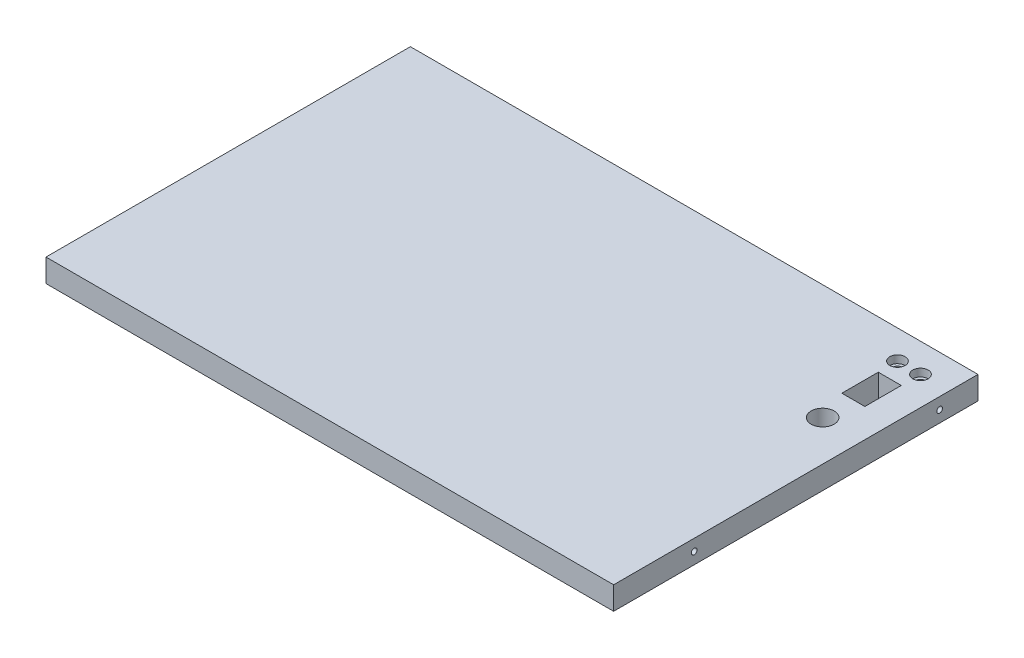
ISO-10303-21;
HEADER;
FILE_DESCRIPTION(('STEP AP214'),'2;1');
FILE_NAME('part.step','',(''),(''),'','','');
FILE_SCHEMA(('AUTOMOTIVE_DESIGN { 1 0 10303 214 1 1 1 1 }'));
ENDSEC;
DATA;
#1=APPLICATION_CONTEXT('core data for automotive mechanical design processes');
#2=APPLICATION_PROTOCOL_DEFINITION('international standard','automotive_design',2000,#1);
#3=PRODUCT_CONTEXT('',#1,'mechanical');
#4=PRODUCT('Part','Part','',(#3));
#5=PRODUCT_RELATED_PRODUCT_CATEGORY('part','',(#4));
#6=PRODUCT_DEFINITION_FORMATION('','',#4);
#7=PRODUCT_DEFINITION_CONTEXT('part definition',#1,'design');
#8=PRODUCT_DEFINITION('design','',#6,#7);
#9=PRODUCT_DEFINITION_SHAPE('','',#8);
#10=(LENGTH_UNIT() NAMED_UNIT(*) SI_UNIT(.MILLI.,.METRE.));
#11=(NAMED_UNIT(*) PLANE_ANGLE_UNIT() SI_UNIT($,.RADIAN.));
#12=(NAMED_UNIT(*) SI_UNIT($,.STERADIAN.) SOLID_ANGLE_UNIT());
#13=UNCERTAINTY_MEASURE_WITH_UNIT(LENGTH_MEASURE(1.E-05),#10,'distance_accuracy_value','');
#14=(GEOMETRIC_REPRESENTATION_CONTEXT(3) GLOBAL_UNCERTAINTY_ASSIGNED_CONTEXT((#13)) GLOBAL_UNIT_ASSIGNED_CONTEXT((#10,
#11,#12)) REPRESENTATION_CONTEXT('',''));
#15=CARTESIAN_POINT('',(0.,0.,0.));
#16=DIRECTION('',(0.,0.,1.));
#17=DIRECTION('',(1.,0.,0.));
#18=AXIS2_PLACEMENT_3D('',#15,#16,#17);
#19=CARTESIAN_POINT('',(77.787049363223,12.,-103.31238787846));
#20=DIRECTION('',(0.,-1.,0.));
#21=DIRECTION('',(0.,0.,-1.));
#22=AXIS2_PLACEMENT_3D('',#19,#20,#21);
#23=CYLINDRICAL_SURFACE('',#22,2.50000000000001);
#24=CARTESIAN_POINT('',(77.787049363223,0.,-103.31238787846));
#25=DIRECTION('',(0.,1.,0.));
#26=DIRECTION('',(0.,0.,1.));
#27=AXIS2_PLACEMENT_3D('',#24,#25,#26);
#28=CIRCLE('',#27,2.50000000000001);
#29=CARTESIAN_POINT('',(77.787049363223,0.,-100.81238787846));
#30=VERTEX_POINT('',#29);
#31=EDGE_CURVE('E201',#30,#30,#28,.T.);
#32=ORIENTED_EDGE('',*,*,#31,.F.);
#33=EDGE_LOOP('',(#32));
#34=FACE_BOUND('',#33,.T.);
#35=CARTESIAN_POINT('',(77.787049363223,8.,-103.31238787846));
#36=DIRECTION('',(0.,1.,0.));
#37=DIRECTION('',(0.,0.,1.));
#38=AXIS2_PLACEMENT_3D('',#35,#36,#37);
#39=CIRCLE('',#38,2.50000000000001);
#40=CARTESIAN_POINT('',(77.787049363223,8.,-100.81238787846));
#41=VERTEX_POINT('',#40);
#42=EDGE_CURVE('E36',#41,#41,#39,.T.);
#43=ORIENTED_EDGE('',*,*,#42,.T.);
#44=EDGE_LOOP('',(#43));
#45=FACE_BOUND('',#44,.T.);
#46=ADVANCED_FACE('F32',(#34,#45),#23,.F.);
#47=CARTESIAN_POINT('',(89.787049363223,12.,-103.31238787846));
#48=DIRECTION('',(0.,-1.,0.));
#49=DIRECTION('',(0.,0.,-1.));
#50=AXIS2_PLACEMENT_3D('',#47,#48,#49);
#51=CYLINDRICAL_SURFACE('',#50,2.5);
#52=CARTESIAN_POINT('',(89.787049363223,0.,-103.31238787846));
#53=DIRECTION('',(0.,1.,0.));
#54=DIRECTION('',(0.,0.,1.));
#55=AXIS2_PLACEMENT_3D('',#52,#53,#54);
#56=CIRCLE('',#55,2.5);
#57=CARTESIAN_POINT('',(89.787049363223,0.,-100.81238787846));
#58=VERTEX_POINT('',#57);
#59=EDGE_CURVE('E206',#58,#58,#56,.T.);
#60=ORIENTED_EDGE('',*,*,#59,.F.);
#61=EDGE_LOOP('',(#60));
#62=FACE_BOUND('',#61,.T.);
#63=CARTESIAN_POINT('',(89.787049363223,8.,-103.31238787846));
#64=DIRECTION('',(0.,1.,0.));
#65=DIRECTION('',(0.,0.,1.));
#66=AXIS2_PLACEMENT_3D('',#63,#64,#65);
#67=CIRCLE('',#66,2.5);
#68=CARTESIAN_POINT('',(89.787049363223,8.,-100.81238787846));
#69=VERTEX_POINT('',#68);
#70=EDGE_CURVE('E163',#69,#69,#67,.T.);
#71=ORIENTED_EDGE('',*,*,#70,.T.);
#72=EDGE_LOOP('',(#71));
#73=FACE_BOUND('',#72,.T.);
#74=ADVANCED_FACE('F234',(#62,#73),#51,.F.);
#75=CARTESIAN_POINT('',(0.,12.,0.));
#76=DIRECTION('',(0.,1.,0.));
#77=DIRECTION('',(0.,0.,1.));
#78=AXIS2_PLACEMENT_3D('',#75,#76,#77);
#79=PLANE('',#78);
#80=CARTESIAN_POINT('',(77.787049363223,12.,-103.31238787846));
#81=DIRECTION('',(0.,1.,0.));
#82=DIRECTION('',(0.,0.,1.));
#83=AXIS2_PLACEMENT_3D('',#80,#81,#82);
#84=CIRCLE('',#83,3.99999999999999);
#85=CARTESIAN_POINT('',(77.787049363223,12.,-99.3123878784597));
#86=VERTEX_POINT('',#85);
#87=EDGE_CURVE('E180',#86,#86,#84,.T.);
#88=ORIENTED_EDGE('',*,*,#87,.F.);
#89=EDGE_LOOP('',(#88));
#90=FACE_BOUND('',#89,.T.);
#91=CARTESIAN_POINT('',(89.787049363223,12.,-103.31238787846));
#92=DIRECTION('',(0.,1.,0.));
#93=DIRECTION('',(0.,0.,1.));
#94=AXIS2_PLACEMENT_3D('',#91,#92,#93);
#95=CIRCLE('',#94,3.99999999999999);
#96=CARTESIAN_POINT('',(89.787049363223,12.,-99.3123878784597));
#97=VERTEX_POINT('',#96);
#98=EDGE_CURVE('E173',#97,#97,#95,.T.);
#99=ORIENTED_EDGE('',*,*,#98,.F.);
#100=EDGE_LOOP('',(#99));
#101=FACE_BOUND('',#100,.T.);
#102=DIRECTION('',(1.,0.,0.));
#103=VECTOR('',#102,1.);
#104=CARTESIAN_POINT('',(77.787049363223,12.,-74.3123878784597));
#105=LINE('',#104,#103);
#106=CARTESIAN_POINT('',(77.787049363223,12.,-74.3123878784597));
#107=VERTEX_POINT('',#106);
#108=CARTESIAN_POINT('',(89.787049363223,12.,-74.3123878784597));
#109=VERTEX_POINT('',#108);
#110=EDGE_CURVE('E107',#107,#109,#105,.T.);
#111=ORIENTED_EDGE('',*,*,#110,.F.);
#112=DIRECTION('',(0.,0.,1.));
#113=VECTOR('',#112,1.);
#114=CARTESIAN_POINT('',(77.787049363223,12.,-93.3123878784597));
#115=LINE('',#114,#113);
#116=CARTESIAN_POINT('',(77.787049363223,12.,-93.3123878784597));
#117=VERTEX_POINT('',#116);
#118=EDGE_CURVE('E99',#117,#107,#115,.T.);
#119=ORIENTED_EDGE('',*,*,#118,.F.);
#120=DIRECTION('',(-1.,0.,0.));
#121=VECTOR('',#120,1.);
#122=CARTESIAN_POINT('',(77.787049363223,12.,-93.3123878784597));
#123=LINE('',#122,#121);
#124=CARTESIAN_POINT('',(89.787049363223,12.,-93.3123878784597));
#125=VERTEX_POINT('',#124);
#126=EDGE_CURVE('E123',#125,#117,#123,.T.);
#127=ORIENTED_EDGE('',*,*,#126,.F.);
#128=DIRECTION('',(0.,0.,-1.));
#129=VECTOR('',#128,1.);
#130=CARTESIAN_POINT('',(89.787049363223,12.,-93.3123878784597));
#131=LINE('',#130,#129);
#132=EDGE_CURVE('E121',#109,#125,#131,.T.);
#133=ORIENTED_EDGE('',*,*,#132,.F.);
#134=EDGE_LOOP('',(#111,#119,#127,#133));
#135=FACE_BOUND('',#134,.T.);
#136=DIRECTION('',(0.,0.,1.));
#137=VECTOR('',#136,1.);
#138=CARTESIAN_POINT('',(-191.212950636777,12.,-118.31238787846));
#139=LINE('',#138,#137);
#140=CARTESIAN_POINT('',(-191.212950636777,12.,-118.31238787846));
#141=VERTEX_POINT('',#140);
#142=CARTESIAN_POINT('',(-191.212950636777,12.,71.6876121215403));
#143=VERTEX_POINT('',#142);
#144=EDGE_CURVE('E139',#141,#143,#139,.T.);
#145=ORIENTED_EDGE('',*,*,#144,.T.);
#146=DIRECTION('',(1.,0.,0.));
#147=VECTOR('',#146,1.);
#148=CARTESIAN_POINT('',(-191.212950636777,12.,71.6876121215403));
#149=LINE('',#148,#147);
#150=CARTESIAN_POINT('',(104.787049363223,12.,71.6876121215403));
#151=VERTEX_POINT('',#150);
#152=EDGE_CURVE('E142',#143,#151,#149,.T.);
#153=ORIENTED_EDGE('',*,*,#152,.T.);
#154=DIRECTION('',(0.,0.,-1.));
#155=VECTOR('',#154,1.);
#156=CARTESIAN_POINT('',(104.787049363223,12.,-118.31238787846));
#157=LINE('',#156,#155);
#158=CARTESIAN_POINT('',(104.787049363223,12.,-118.31238787846));
#159=VERTEX_POINT('',#158);
#160=EDGE_CURVE('E145',#151,#159,#157,.T.);
#161=ORIENTED_EDGE('',*,*,#160,.T.);
#162=DIRECTION('',(-1.,0.,0.));
#163=VECTOR('',#162,1.);
#164=CARTESIAN_POINT('',(-191.212950636777,12.,-118.31238787846));
#165=LINE('',#164,#163);
#166=EDGE_CURVE('E147',#159,#141,#165,.T.);
#167=ORIENTED_EDGE('',*,*,#166,.T.);
#168=EDGE_LOOP('',(#145,#153,#161,#167));
#169=FACE_BOUND('',#168,.T.);
#170=CARTESIAN_POINT('',(83.787049363223,12.,-58.3123878784597));
#171=DIRECTION('',(0.,1.,0.));
#172=DIRECTION('',(0.,0.,1.));
#173=AXIS2_PLACEMENT_3D('',#170,#171,#172);
#174=CIRCLE('',#173,6.00000000000002);
#175=CARTESIAN_POINT('',(83.787049363223,12.,-52.3123878784597));
#176=VERTEX_POINT('',#175);
#177=EDGE_CURVE('E129',#176,#176,#174,.T.);
#178=ORIENTED_EDGE('',*,*,#177,.F.);
#179=EDGE_LOOP('',(#178));
#180=FACE_BOUND('',#179,.T.);
#181=ADVANCED_FACE('F119',(#90,#101,#135,#169,#180),#79,.T.);
#182=CARTESIAN_POINT('',(0.,0.,0.));
#183=DIRECTION('',(0.,1.,0.));
#184=DIRECTION('',(0.,0.,1.));
#185=AXIS2_PLACEMENT_3D('',#182,#183,#184);
#186=PLANE('',#185);
#187=DIRECTION('',(0.,0.,1.));
#188=VECTOR('',#187,1.);
#189=CARTESIAN_POINT('',(-191.212950636777,0.,-118.31238787846));
#190=LINE('',#189,#188);
#191=CARTESIAN_POINT('',(-191.212950636777,0.,-118.31238787846));
#192=VERTEX_POINT('',#191);
#193=CARTESIAN_POINT('',(-191.212950636777,0.,71.6876121215403));
#194=VERTEX_POINT('',#193);
#195=EDGE_CURVE('E115',#192,#194,#190,.T.);
#196=ORIENTED_EDGE('',*,*,#195,.F.);
#197=DIRECTION('',(-1.,0.,0.));
#198=VECTOR('',#197,1.);
#199=CARTESIAN_POINT('',(-191.212950636777,0.,-118.31238787846));
#200=LINE('',#199,#198);
#201=CARTESIAN_POINT('',(104.787049363223,0.,-118.31238787846));
#202=VERTEX_POINT('',#201);
#203=EDGE_CURVE('E143',#202,#192,#200,.T.);
#204=ORIENTED_EDGE('',*,*,#203,.F.);
#205=DIRECTION('',(0.,0.,-1.));
#206=VECTOR('',#205,1.);
#207=CARTESIAN_POINT('',(104.787049363223,0.,-118.31238787846));
#208=LINE('',#207,#206);
#209=CARTESIAN_POINT('',(104.787049363223,0.,71.6876121215403));
#210=VERTEX_POINT('',#209);
#211=EDGE_CURVE('E154',#210,#202,#208,.T.);
#212=ORIENTED_EDGE('',*,*,#211,.F.);
#213=DIRECTION('',(1.,0.,0.));
#214=VECTOR('',#213,1.);
#215=CARTESIAN_POINT('',(-191.212950636777,0.,71.6876121215403));
#216=LINE('',#215,#214);
#217=EDGE_CURVE('E152',#194,#210,#216,.T.);
#218=ORIENTED_EDGE('',*,*,#217,.F.);
#219=EDGE_LOOP('',(#196,#204,#212,#218));
#220=FACE_BOUND('',#219,.T.);
#221=DIRECTION('',(0.,0.,1.));
#222=VECTOR('',#221,1.);
#223=CARTESIAN_POINT('',(77.787049363223,0.,-93.3123878784597));
#224=LINE('',#223,#222);
#225=CARTESIAN_POINT('',(77.787049363223,0.,-93.3123878784597));
#226=VERTEX_POINT('',#225);
#227=CARTESIAN_POINT('',(77.787049363223,0.,-74.3123878784597));
#228=VERTEX_POINT('',#227);
#229=EDGE_CURVE('E57',#226,#228,#224,.T.);
#230=ORIENTED_EDGE('',*,*,#229,.T.);
#231=DIRECTION('',(1.,0.,0.));
#232=VECTOR('',#231,1.);
#233=CARTESIAN_POINT('',(77.787049363223,0.,-74.3123878784597));
#234=LINE('',#233,#232);
#235=CARTESIAN_POINT('',(89.787049363223,0.,-74.3123878784597));
#236=VERTEX_POINT('',#235);
#237=EDGE_CURVE('E114',#228,#236,#234,.T.);
#238=ORIENTED_EDGE('',*,*,#237,.T.);
#239=DIRECTION('',(0.,0.,-1.));
#240=VECTOR('',#239,1.);
#241=CARTESIAN_POINT('',(89.787049363223,0.,-93.3123878784597));
#242=LINE('',#241,#240);
#243=CARTESIAN_POINT('',(89.787049363223,0.,-93.3123878784597));
#244=VERTEX_POINT('',#243);
#245=EDGE_CURVE('E131',#236,#244,#242,.T.);
#246=ORIENTED_EDGE('',*,*,#245,.T.);
#247=DIRECTION('',(-1.,0.,0.));
#248=VECTOR('',#247,1.);
#249=CARTESIAN_POINT('',(77.787049363223,0.,-93.3123878784597));
#250=LINE('',#249,#248);
#251=EDGE_CURVE('E108',#244,#226,#250,.T.);
#252=ORIENTED_EDGE('',*,*,#251,.T.);
#253=EDGE_LOOP('',(#230,#238,#246,#252));
#254=FACE_BOUND('',#253,.T.);
#255=CARTESIAN_POINT('',(83.787049363223,0.,-58.3123878784597));
#256=DIRECTION('',(0.,1.,0.));
#257=DIRECTION('',(0.,0.,1.));
#258=AXIS2_PLACEMENT_3D('',#255,#256,#257);
#259=CIRCLE('',#258,6.00000000000002);
#260=CARTESIAN_POINT('',(83.787049363223,0.,-52.3123878784597));
#261=VERTEX_POINT('',#260);
#262=EDGE_CURVE('E209',#261,#261,#259,.T.);
#263=ORIENTED_EDGE('',*,*,#262,.T.);
#264=EDGE_LOOP('',(#263));
#265=FACE_BOUND('',#264,.T.);
#266=ORIENTED_EDGE('',*,*,#59,.T.);
#267=EDGE_LOOP('',(#266));
#268=FACE_BOUND('',#267,.T.);
#269=ORIENTED_EDGE('',*,*,#31,.T.);
#270=EDGE_LOOP('',(#269));
#271=FACE_BOUND('',#270,.T.);
#272=ADVANCED_FACE('F214',(#220,#254,#265,#268,#271),#186,.F.);
#273=CARTESIAN_POINT('',(-191.212950636777,12.,-118.31238787846));
#274=DIRECTION('',(1.,0.,0.));
#275=DIRECTION('',(0.,0.,-1.));
#276=AXIS2_PLACEMENT_3D('',#273,#274,#275);
#277=PLANE('',#276);
#278=CARTESIAN_POINT('',(-191.212950636777,6.,29.6876121215403));
#279=DIRECTION('',(1.,0.,0.));
#280=DIRECTION('',(0.,0.,-1.));
#281=AXIS2_PLACEMENT_3D('',#278,#279,#280);
#282=CIRCLE('',#281,1.5);
#283=CARTESIAN_POINT('',(-191.212950636777,6.,28.1876121215403));
#284=VERTEX_POINT('',#283);
#285=EDGE_CURVE('E165',#284,#284,#282,.T.);
#286=ORIENTED_EDGE('',*,*,#285,.T.);
#287=EDGE_LOOP('',(#286));
#288=FACE_BOUND('',#287,.T.);
#289=CARTESIAN_POINT('',(-191.212950636777,6.,-98.3123878784597));
#290=DIRECTION('',(1.,0.,0.));
#291=DIRECTION('',(0.,0.,-1.));
#292=AXIS2_PLACEMENT_3D('',#289,#290,#291);
#293=CIRCLE('',#292,1.5);
#294=CARTESIAN_POINT('',(-191.212950636777,6.,-99.8123878784597));
#295=VERTEX_POINT('',#294);
#296=EDGE_CURVE('E184',#295,#295,#293,.T.);
#297=ORIENTED_EDGE('',*,*,#296,.T.);
#298=EDGE_LOOP('',(#297));
#299=FACE_BOUND('',#298,.T.);
#300=ORIENTED_EDGE('',*,*,#195,.T.);
#301=DIRECTION('',(0.,-1.,0.));
#302=VECTOR('',#301,1.);
#303=CARTESIAN_POINT('',(-191.212950636777,12.,71.6876121215403));
#304=LINE('',#303,#302);
#305=EDGE_CURVE('E11',#143,#194,#304,.T.);
#306=ORIENTED_EDGE('',*,*,#305,.F.);
#307=ORIENTED_EDGE('',*,*,#144,.F.);
#308=DIRECTION('',(0.,-1.,0.));
#309=VECTOR('',#308,1.);
#310=CARTESIAN_POINT('',(-191.212950636777,12.,-118.31238787846));
#311=LINE('',#310,#309);
#312=EDGE_CURVE('E149',#141,#192,#311,.T.);
#313=ORIENTED_EDGE('',*,*,#312,.T.);
#314=EDGE_LOOP('',(#300,#306,#307,#313));
#315=FACE_BOUND('',#314,.T.);
#316=ADVANCED_FACE('F34',(#288,#299,#315),#277,.F.);
#317=CARTESIAN_POINT('',(-191.212950636777,12.,71.6876121215403));
#318=DIRECTION('',(0.,0.,-1.));
#319=DIRECTION('',(-1.,0.,0.));
#320=AXIS2_PLACEMENT_3D('',#317,#318,#319);
#321=PLANE('',#320);
#322=ORIENTED_EDGE('',*,*,#217,.T.);
#323=DIRECTION('',(0.,-1.,0.));
#324=VECTOR('',#323,1.);
#325=CARTESIAN_POINT('',(104.787049363223,12.,71.6876121215403));
#326=LINE('',#325,#324);
#327=EDGE_CURVE('E41',#151,#210,#326,.T.);
#328=ORIENTED_EDGE('',*,*,#327,.F.);
#329=ORIENTED_EDGE('',*,*,#152,.F.);
#330=ORIENTED_EDGE('',*,*,#305,.T.);
#331=EDGE_LOOP('',(#322,#328,#329,#330));
#332=FACE_BOUND('',#331,.T.);
#333=ADVANCED_FACE('F317',(#332),#321,.F.);
#334=CARTESIAN_POINT('',(104.787049363223,12.,-118.31238787846));
#335=DIRECTION('',(-1.,0.,0.));
#336=DIRECTION('',(0.,0.,1.));
#337=AXIS2_PLACEMENT_3D('',#334,#335,#336);
#338=PLANE('',#337);
#339=CARTESIAN_POINT('',(104.787049363223,6.,29.6876121215403));
#340=DIRECTION('',(-1.,0.,0.));
#341=DIRECTION('',(0.,0.,1.));
#342=AXIS2_PLACEMENT_3D('',#339,#340,#341);
#343=CIRCLE('',#342,1.5);
#344=CARTESIAN_POINT('',(104.787049363223,6.,31.1876121215403));
#345=VERTEX_POINT('',#344);
#346=EDGE_CURVE('E189',#345,#345,#343,.T.);
#347=ORIENTED_EDGE('',*,*,#346,.T.);
#348=EDGE_LOOP('',(#347));
#349=FACE_BOUND('',#348,.T.);
#350=CARTESIAN_POINT('',(104.787049363223,6.,-98.3123878784597));
#351=DIRECTION('',(-1.,0.,0.));
#352=DIRECTION('',(0.,0.,1.));
#353=AXIS2_PLACEMENT_3D('',#350,#351,#352);
#354=CIRCLE('',#353,1.5);
#355=CARTESIAN_POINT('',(104.787049363223,6.,-96.8123878784597));
#356=VERTEX_POINT('',#355);
#357=EDGE_CURVE('E195',#356,#356,#354,.T.);
#358=ORIENTED_EDGE('',*,*,#357,.T.);
#359=EDGE_LOOP('',(#358));
#360=FACE_BOUND('',#359,.T.);
#361=ORIENTED_EDGE('',*,*,#211,.T.);
#362=DIRECTION('',(0.,-1.,0.));
#363=VECTOR('',#362,1.);
#364=CARTESIAN_POINT('',(104.787049363223,12.,-118.31238787846));
#365=LINE('',#364,#363);
#366=EDGE_CURVE('E159',#159,#202,#365,.T.);
#367=ORIENTED_EDGE('',*,*,#366,.F.);
#368=ORIENTED_EDGE('',*,*,#160,.F.);
#369=ORIENTED_EDGE('',*,*,#327,.T.);
#370=EDGE_LOOP('',(#361,#367,#368,#369));
#371=FACE_BOUND('',#370,.T.);
#372=ADVANCED_FACE('F314',(#349,#360,#371),#338,.F.);
#373=CARTESIAN_POINT('',(-191.212950636777,12.,-118.31238787846));
#374=DIRECTION('',(0.,0.,1.));
#375=DIRECTION('',(1.,0.,0.));
#376=AXIS2_PLACEMENT_3D('',#373,#374,#375);
#377=PLANE('',#376);
#378=ORIENTED_EDGE('',*,*,#203,.T.);
#379=ORIENTED_EDGE('',*,*,#312,.F.);
#380=ORIENTED_EDGE('',*,*,#166,.F.);
#381=ORIENTED_EDGE('',*,*,#366,.T.);
#382=EDGE_LOOP('',(#378,#379,#380,#381));
#383=FACE_BOUND('',#382,.T.);
#384=ADVANCED_FACE('F311',(#383),#377,.F.);
#385=CARTESIAN_POINT('',(77.787049363223,12.,-93.3123878784597));
#386=DIRECTION('',(1.,0.,0.));
#387=DIRECTION('',(0.,0.,-1.));
#388=AXIS2_PLACEMENT_3D('',#385,#386,#387);
#389=PLANE('',#388);
#390=ORIENTED_EDGE('',*,*,#229,.F.);
#391=DIRECTION('',(0.,-1.,0.));
#392=VECTOR('',#391,1.);
#393=CARTESIAN_POINT('',(77.787049363223,12.,-93.3123878784597));
#394=LINE('',#393,#392);
#395=EDGE_CURVE('E103',#117,#226,#394,.T.);
#396=ORIENTED_EDGE('',*,*,#395,.F.);
#397=ORIENTED_EDGE('',*,*,#118,.T.);
#398=DIRECTION('',(0.,-1.,0.));
#399=VECTOR('',#398,1.);
#400=CARTESIAN_POINT('',(77.787049363223,12.,-74.3123878784597));
#401=LINE('',#400,#399);
#402=EDGE_CURVE('E102',#107,#228,#401,.T.);
#403=ORIENTED_EDGE('',*,*,#402,.T.);
#404=EDGE_LOOP('',(#390,#396,#397,#403));
#405=FACE_BOUND('',#404,.T.);
#406=ADVANCED_FACE('F101',(#405),#389,.T.);
#407=CARTESIAN_POINT('',(77.787049363223,12.,-74.3123878784597));
#408=DIRECTION('',(0.,0.,-1.));
#409=DIRECTION('',(-1.,0.,0.));
#410=AXIS2_PLACEMENT_3D('',#407,#408,#409);
#411=PLANE('',#410);
#412=ORIENTED_EDGE('',*,*,#237,.F.);
#413=ORIENTED_EDGE('',*,*,#402,.F.);
#414=ORIENTED_EDGE('',*,*,#110,.T.);
#415=DIRECTION('',(0.,-1.,0.));
#416=VECTOR('',#415,1.);
#417=CARTESIAN_POINT('',(89.787049363223,12.,-74.3123878784597));
#418=LINE('',#417,#416);
#419=EDGE_CURVE('E116',#109,#236,#418,.T.);
#420=ORIENTED_EDGE('',*,*,#419,.T.);
#421=EDGE_LOOP('',(#412,#413,#414,#420));
#422=FACE_BOUND('',#421,.T.);
#423=ADVANCED_FACE('F111',(#422),#411,.T.);
#424=CARTESIAN_POINT('',(89.787049363223,12.,-93.3123878784597));
#425=DIRECTION('',(-1.,0.,0.));
#426=DIRECTION('',(0.,0.,1.));
#427=AXIS2_PLACEMENT_3D('',#424,#425,#426);
#428=PLANE('',#427);
#429=ORIENTED_EDGE('',*,*,#245,.F.);
#430=ORIENTED_EDGE('',*,*,#419,.F.);
#431=ORIENTED_EDGE('',*,*,#132,.T.);
#432=DIRECTION('',(0.,-1.,0.));
#433=VECTOR('',#432,1.);
#434=CARTESIAN_POINT('',(89.787049363223,12.,-93.3123878784597));
#435=LINE('',#434,#433);
#436=EDGE_CURVE('E49',#125,#244,#435,.T.);
#437=ORIENTED_EDGE('',*,*,#436,.T.);
#438=EDGE_LOOP('',(#429,#430,#431,#437));
#439=FACE_BOUND('',#438,.T.);
#440=ADVANCED_FACE('F230',(#439),#428,.T.);
#441=CARTESIAN_POINT('',(77.787049363223,12.,-93.3123878784597));
#442=DIRECTION('',(0.,0.,1.));
#443=DIRECTION('',(1.,0.,0.));
#444=AXIS2_PLACEMENT_3D('',#441,#442,#443);
#445=PLANE('',#444);
#446=ORIENTED_EDGE('',*,*,#251,.F.);
#447=ORIENTED_EDGE('',*,*,#436,.F.);
#448=ORIENTED_EDGE('',*,*,#126,.T.);
#449=ORIENTED_EDGE('',*,*,#395,.T.);
#450=EDGE_LOOP('',(#446,#447,#448,#449));
#451=FACE_BOUND('',#450,.T.);
#452=ADVANCED_FACE('F220',(#451),#445,.T.);
#453=CARTESIAN_POINT('',(83.787049363223,12.,-58.3123878784597));
#454=DIRECTION('',(0.,-1.,0.));
#455=DIRECTION('',(0.,0.,-1.));
#456=AXIS2_PLACEMENT_3D('',#453,#454,#455);
#457=CYLINDRICAL_SURFACE('',#456,6.00000000000002);
#458=ORIENTED_EDGE('',*,*,#177,.T.);
#459=EDGE_LOOP('',(#458));
#460=FACE_BOUND('',#459,.T.);
#461=ORIENTED_EDGE('',*,*,#262,.F.);
#462=EDGE_LOOP('',(#461));
#463=FACE_BOUND('',#462,.T.);
#464=ADVANCED_FACE('F217',(#460,#463),#457,.F.);
#465=CARTESIAN_POINT('',(84.787049363223,6.,-98.3123878784597));
#466=DIRECTION('',(1.,0.,0.));
#467=DIRECTION('',(0.,0.,-1.));
#468=AXIS2_PLACEMENT_3D('',#465,#466,#467);
#469=CYLINDRICAL_SURFACE('',#468,1.5);
#470=CARTESIAN_POINT('',(84.787049363223,6.,-98.3123878784597));
#471=DIRECTION('',(-1.,0.,0.));
#472=DIRECTION('',(0.,0.,1.));
#473=AXIS2_PLACEMENT_3D('',#470,#471,#472);
#474=CIRCLE('',#473,1.5);
#475=CARTESIAN_POINT('',(84.787049363223,6.,-96.8123878784597));
#476=VERTEX_POINT('',#475);
#477=EDGE_CURVE('E198',#476,#476,#474,.T.);
#478=ORIENTED_EDGE('',*,*,#477,.T.);
#479=EDGE_LOOP('',(#478));
#480=FACE_BOUND('',#479,.T.);
#481=ORIENTED_EDGE('',*,*,#357,.F.);
#482=EDGE_LOOP('',(#481));
#483=FACE_BOUND('',#482,.T.);
#484=ADVANCED_FACE('F219',(#480,#483),#469,.F.);
#485=CARTESIAN_POINT('',(84.787049363223,6.,-98.3123878784597));
#486=DIRECTION('',(-1.,0.,0.));
#487=DIRECTION('',(0.,0.,1.));
#488=AXIS2_PLACEMENT_3D('',#485,#486,#487);
#489=PLANE('',#488);
#490=ORIENTED_EDGE('',*,*,#477,.F.);
#491=EDGE_LOOP('',(#490));
#492=FACE_BOUND('',#491,.T.);
#493=ADVANCED_FACE('F227',(#492),#489,.F.);
#494=CARTESIAN_POINT('',(84.787049363223,6.,29.6876121215403));
#495=DIRECTION('',(1.,0.,0.));
#496=DIRECTION('',(0.,0.,-1.));
#497=AXIS2_PLACEMENT_3D('',#494,#495,#496);
#498=CYLINDRICAL_SURFACE('',#497,1.5);
#499=CARTESIAN_POINT('',(84.787049363223,6.,29.6876121215403));
#500=DIRECTION('',(-1.,0.,0.));
#501=DIRECTION('',(0.,0.,1.));
#502=AXIS2_PLACEMENT_3D('',#499,#500,#501);
#503=CIRCLE('',#502,1.5);
#504=CARTESIAN_POINT('',(84.787049363223,6.,31.1876121215403));
#505=VERTEX_POINT('',#504);
#506=EDGE_CURVE('E192',#505,#505,#503,.T.);
#507=ORIENTED_EDGE('',*,*,#506,.T.);
#508=EDGE_LOOP('',(#507));
#509=FACE_BOUND('',#508,.T.);
#510=ORIENTED_EDGE('',*,*,#346,.F.);
#511=EDGE_LOOP('',(#510));
#512=FACE_BOUND('',#511,.T.);
#513=ADVANCED_FACE('F246',(#509,#512),#498,.F.);
#514=CARTESIAN_POINT('',(84.787049363223,6.,29.6876121215403));
#515=DIRECTION('',(-1.,0.,0.));
#516=DIRECTION('',(0.,0.,1.));
#517=AXIS2_PLACEMENT_3D('',#514,#515,#516);
#518=PLANE('',#517);
#519=ORIENTED_EDGE('',*,*,#506,.F.);
#520=EDGE_LOOP('',(#519));
#521=FACE_BOUND('',#520,.T.);
#522=ADVANCED_FACE('F250',(#521),#518,.F.);
#523=CARTESIAN_POINT('',(-171.212950636777,6.,-98.3123878784597));
#524=DIRECTION('',(-1.,0.,0.));
#525=DIRECTION('',(0.,0.,1.));
#526=AXIS2_PLACEMENT_3D('',#523,#524,#525);
#527=CYLINDRICAL_SURFACE('',#526,1.5);
#528=CARTESIAN_POINT('',(-171.212950636777,6.,-98.3123878784597));
#529=DIRECTION('',(1.,0.,0.));
#530=DIRECTION('',(0.,0.,-1.));
#531=AXIS2_PLACEMENT_3D('',#528,#529,#530);
#532=CIRCLE('',#531,1.5);
#533=CARTESIAN_POINT('',(-171.212950636777,6.,-99.8123878784597));
#534=VERTEX_POINT('',#533);
#535=EDGE_CURVE('E186',#534,#534,#532,.T.);
#536=ORIENTED_EDGE('',*,*,#535,.T.);
#537=EDGE_LOOP('',(#536));
#538=FACE_BOUND('',#537,.T.);
#539=ORIENTED_EDGE('',*,*,#296,.F.);
#540=EDGE_LOOP('',(#539));
#541=FACE_BOUND('',#540,.T.);
#542=ADVANCED_FACE('F254',(#538,#541),#527,.F.);
#543=CARTESIAN_POINT('',(-171.212950636777,6.,-98.3123878784597));
#544=DIRECTION('',(1.,0.,0.));
#545=DIRECTION('',(0.,0.,-1.));
#546=AXIS2_PLACEMENT_3D('',#543,#544,#545);
#547=PLANE('',#546);
#548=ORIENTED_EDGE('',*,*,#535,.F.);
#549=EDGE_LOOP('',(#548));
#550=FACE_BOUND('',#549,.T.);
#551=ADVANCED_FACE('F258',(#550),#547,.F.);
#552=CARTESIAN_POINT('',(-171.212950636777,6.,29.6876121215403));
#553=DIRECTION('',(-1.,0.,0.));
#554=DIRECTION('',(0.,0.,1.));
#555=AXIS2_PLACEMENT_3D('',#552,#553,#554);
#556=CYLINDRICAL_SURFACE('',#555,1.5);
#557=CARTESIAN_POINT('',(-171.212950636777,6.,29.6876121215403));
#558=DIRECTION('',(1.,0.,0.));
#559=DIRECTION('',(0.,0.,-1.));
#560=AXIS2_PLACEMENT_3D('',#557,#558,#559);
#561=CIRCLE('',#560,1.5);
#562=CARTESIAN_POINT('',(-171.212950636777,6.,28.1876121215403));
#563=VERTEX_POINT('',#562);
#564=EDGE_CURVE('E170',#563,#563,#561,.T.);
#565=ORIENTED_EDGE('',*,*,#564,.T.);
#566=EDGE_LOOP('',(#565));
#567=FACE_BOUND('',#566,.T.);
#568=ORIENTED_EDGE('',*,*,#285,.F.);
#569=EDGE_LOOP('',(#568));
#570=FACE_BOUND('',#569,.T.);
#571=ADVANCED_FACE('F262',(#567,#570),#556,.F.);
#572=CARTESIAN_POINT('',(-171.212950636777,6.,29.6876121215403));
#573=DIRECTION('',(1.,0.,0.));
#574=DIRECTION('',(0.,0.,-1.));
#575=AXIS2_PLACEMENT_3D('',#572,#573,#574);
#576=PLANE('',#575);
#577=ORIENTED_EDGE('',*,*,#564,.F.);
#578=EDGE_LOOP('',(#577));
#579=FACE_BOUND('',#578,.T.);
#580=ADVANCED_FACE('F266',(#579),#576,.F.);
#581=CARTESIAN_POINT('',(89.787049363223,8.,-103.31238787846));
#582=DIRECTION('',(0.,1.,0.));
#583=DIRECTION('',(0.,0.,1.));
#584=AXIS2_PLACEMENT_3D('',#581,#582,#583);
#585=CYLINDRICAL_SURFACE('',#584,3.99999999999999);
#586=CARTESIAN_POINT('',(89.787049363223,8.,-103.31238787846));
#587=DIRECTION('',(0.,1.,0.));
#588=DIRECTION('',(0.,0.,1.));
#589=AXIS2_PLACEMENT_3D('',#586,#587,#588);
#590=CIRCLE('',#589,3.99999999999999);
#591=CARTESIAN_POINT('',(89.787049363223,8.,-99.3123878784597));
#592=VERTEX_POINT('',#591);
#593=EDGE_CURVE('E166',#592,#592,#590,.T.);
#594=ORIENTED_EDGE('',*,*,#593,.F.);
#595=EDGE_LOOP('',(#594));
#596=FACE_BOUND('',#595,.T.);
#597=ORIENTED_EDGE('',*,*,#98,.T.);
#598=EDGE_LOOP('',(#597));
#599=FACE_BOUND('',#598,.T.);
#600=ADVANCED_FACE('F270',(#596,#599),#585,.F.);
#601=CARTESIAN_POINT('',(89.787049363223,8.,-103.31238787846));
#602=DIRECTION('',(0.,1.,0.));
#603=DIRECTION('',(0.,0.,1.));
#604=AXIS2_PLACEMENT_3D('',#601,#602,#603);
#605=PLANE('',#604);
#606=ORIENTED_EDGE('',*,*,#70,.F.);
#607=EDGE_LOOP('',(#606));
#608=FACE_BOUND('',#607,.T.);
#609=ORIENTED_EDGE('',*,*,#593,.T.);
#610=EDGE_LOOP('',(#609));
#611=FACE_BOUND('',#610,.T.);
#612=ADVANCED_FACE('F274',(#608,#611),#605,.T.);
#613=CARTESIAN_POINT('',(77.787049363223,8.,-103.31238787846));
#614=DIRECTION('',(0.,1.,0.));
#615=DIRECTION('',(0.,0.,1.));
#616=AXIS2_PLACEMENT_3D('',#613,#614,#615);
#617=CYLINDRICAL_SURFACE('',#616,3.99999999999999);
#618=CARTESIAN_POINT('',(77.787049363223,8.,-103.31238787846));
#619=DIRECTION('',(0.,1.,0.));
#620=DIRECTION('',(0.,0.,1.));
#621=AXIS2_PLACEMENT_3D('',#618,#619,#620);
#622=CIRCLE('',#621,3.99999999999999);
#623=CARTESIAN_POINT('',(77.787049363223,8.,-99.3123878784597));
#624=VERTEX_POINT('',#623);
#625=EDGE_CURVE('E293',#624,#624,#622,.T.);
#626=ORIENTED_EDGE('',*,*,#625,.F.);
#627=EDGE_LOOP('',(#626));
#628=FACE_BOUND('',#627,.T.);
#629=ORIENTED_EDGE('',*,*,#87,.T.);
#630=EDGE_LOOP('',(#629));
#631=FACE_BOUND('',#630,.T.);
#632=ADVANCED_FACE('F278',(#628,#631),#617,.F.);
#633=CARTESIAN_POINT('',(77.787049363223,8.,-103.31238787846));
#634=DIRECTION('',(0.,1.,0.));
#635=DIRECTION('',(0.,0.,1.));
#636=AXIS2_PLACEMENT_3D('',#633,#634,#635);
#637=PLANE('',#636);
#638=ORIENTED_EDGE('',*,*,#42,.F.);
#639=EDGE_LOOP('',(#638));
#640=FACE_BOUND('',#639,.T.);
#641=ORIENTED_EDGE('',*,*,#625,.T.);
#642=EDGE_LOOP('',(#641));
#643=FACE_BOUND('',#642,.T.);
#644=ADVANCED_FACE('F282',(#640,#643),#637,.T.);
#645=CLOSED_SHELL('',(#46,#74,#181,#272,#316,#333,#372,#384,#406,#423,#440,#452,#464,#484,#493,
#513,#522,#542,#551,#571,#580,#600,#612,#632,#644));
#646=MANIFOLD_SOLID_BREP('B2',#645);
#647=ADVANCED_BREP_SHAPE_REPRESENTATION('',(#18,#646),#14);
#648=SHAPE_DEFINITION_REPRESENTATION(#9,#647);
ENDSEC;
END-ISO-10303-21;
